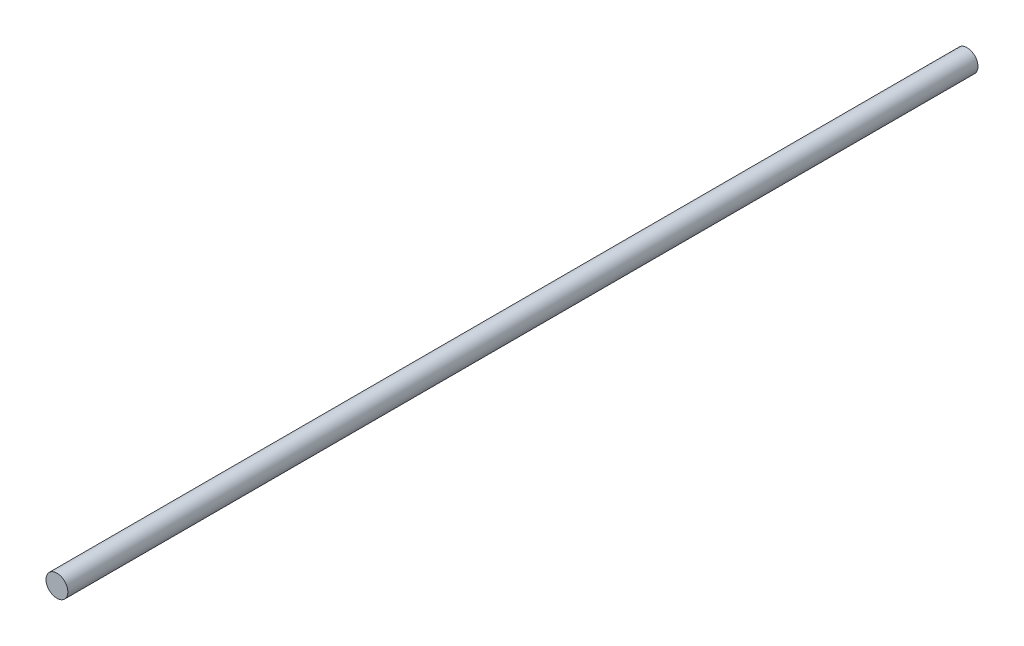
ISO-10303-21;
HEADER;
FILE_DESCRIPTION(('STEP AP214'),'2;1');
FILE_NAME('part.step','',(''),(''),'','','');
FILE_SCHEMA(('AUTOMOTIVE_DESIGN { 1 0 10303 214 1 1 1 1 }'));
ENDSEC;
DATA;
#1=APPLICATION_CONTEXT('core data for automotive mechanical design processes');
#2=APPLICATION_PROTOCOL_DEFINITION('international standard','automotive_design',2000,#1);
#3=PRODUCT_CONTEXT('',#1,'mechanical');
#4=PRODUCT('Part','Part','',(#3));
#5=PRODUCT_RELATED_PRODUCT_CATEGORY('part','',(#4));
#6=PRODUCT_DEFINITION_FORMATION('','',#4);
#7=PRODUCT_DEFINITION_CONTEXT('part definition',#1,'design');
#8=PRODUCT_DEFINITION('design','',#6,#7);
#9=PRODUCT_DEFINITION_SHAPE('','',#8);
#10=(LENGTH_UNIT() NAMED_UNIT(*) SI_UNIT(.MILLI.,.METRE.));
#11=(NAMED_UNIT(*) PLANE_ANGLE_UNIT() SI_UNIT($,.RADIAN.));
#12=(NAMED_UNIT(*) SI_UNIT($,.STERADIAN.) SOLID_ANGLE_UNIT());
#13=UNCERTAINTY_MEASURE_WITH_UNIT(LENGTH_MEASURE(1.E-05),#10,'distance_accuracy_value','');
#14=(GEOMETRIC_REPRESENTATION_CONTEXT(3) GLOBAL_UNCERTAINTY_ASSIGNED_CONTEXT((#13)) GLOBAL_UNIT_ASSIGNED_CONTEXT((#10,
#11,#12)) REPRESENTATION_CONTEXT('',''));
#15=CARTESIAN_POINT('',(0.,0.,0.));
#16=DIRECTION('',(0.,0.,1.));
#17=DIRECTION('',(1.,0.,0.));
#18=AXIS2_PLACEMENT_3D('',#15,#16,#17);
#19=CARTESIAN_POINT('',(0.,0.,250.));
#20=DIRECTION('',(0.,0.,-1.));
#21=DIRECTION('',(-1.,0.,0.));
#22=AXIS2_PLACEMENT_3D('',#19,#20,#21);
#23=CYLINDRICAL_SURFACE('',#22,3.);
#24=CARTESIAN_POINT('',(0.,0.,250.));
#25=DIRECTION('',(0.,0.,1.));
#26=DIRECTION('',(1.,0.,0.));
#27=AXIS2_PLACEMENT_3D('',#24,#25,#26);
#28=CIRCLE('',#27,3.);
#29=CARTESIAN_POINT('',(3.,0.,250.));
#30=VERTEX_POINT('',#29);
#31=EDGE_CURVE('E10',#30,#30,#28,.T.);
#32=ORIENTED_EDGE('',*,*,#31,.F.);
#33=EDGE_LOOP('',(#32));
#34=FACE_BOUND('',#33,.T.);
#35=CARTESIAN_POINT('',(0.,0.,0.));
#36=DIRECTION('',(0.,0.,1.));
#37=DIRECTION('',(1.,0.,0.));
#38=AXIS2_PLACEMENT_3D('',#35,#36,#37);
#39=CIRCLE('',#38,3.);
#40=CARTESIAN_POINT('',(3.,0.,0.));
#41=VERTEX_POINT('',#40);
#42=EDGE_CURVE('E32',#41,#41,#39,.T.);
#43=ORIENTED_EDGE('',*,*,#42,.T.);
#44=EDGE_LOOP('',(#43));
#45=FACE_BOUND('',#44,.T.);
#46=ADVANCED_FACE('F29',(#34,#45),#23,.T.);
#47=CARTESIAN_POINT('',(0.,0.,250.));
#48=DIRECTION('',(0.,0.,1.));
#49=DIRECTION('',(1.,0.,0.));
#50=AXIS2_PLACEMENT_3D('',#47,#48,#49);
#51=PLANE('',#50);
#52=ORIENTED_EDGE('',*,*,#31,.T.);
#53=EDGE_LOOP('',(#52));
#54=FACE_BOUND('',#53,.T.);
#55=ADVANCED_FACE('F44',(#54),#51,.T.);
#56=CARTESIAN_POINT('',(0.,0.,0.));
#57=DIRECTION('',(0.,0.,1.));
#58=DIRECTION('',(1.,0.,0.));
#59=AXIS2_PLACEMENT_3D('',#56,#57,#58);
#60=PLANE('',#59);
#61=ORIENTED_EDGE('',*,*,#42,.F.);
#62=EDGE_LOOP('',(#61));
#63=FACE_BOUND('',#62,.T.);
#64=ADVANCED_FACE('F42',(#63),#60,.F.);
#65=CLOSED_SHELL('',(#46,#55,#64));
#66=MANIFOLD_SOLID_BREP('B2',#65);
#67=ADVANCED_BREP_SHAPE_REPRESENTATION('',(#18,#66),#14);
#68=SHAPE_DEFINITION_REPRESENTATION(#9,#67);
ENDSEC;
END-ISO-10303-21;
